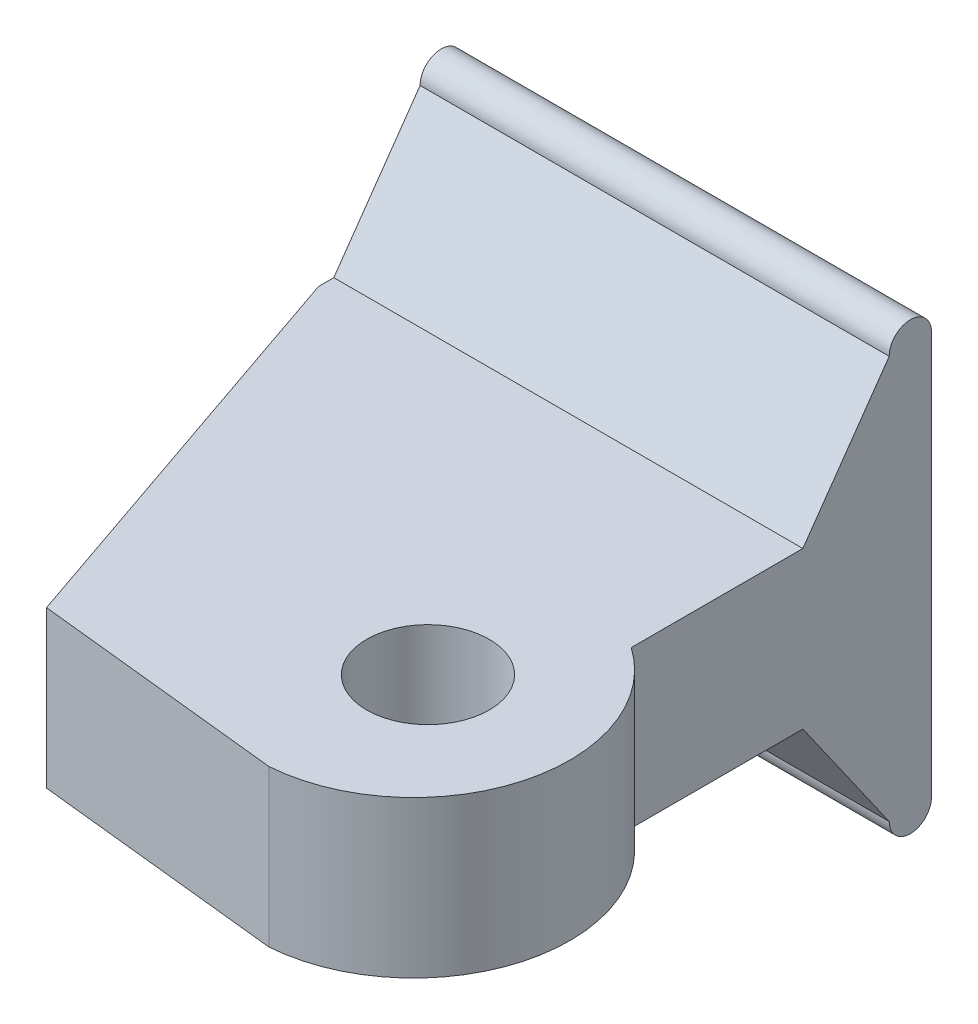
ISO-10303-21;
HEADER;
FILE_DESCRIPTION(('STEP AP214'),'2;1');
FILE_NAME('part.step','',(''),(''),'','','');
FILE_SCHEMA(('AUTOMOTIVE_DESIGN { 1 0 10303 214 1 1 1 1 }'));
ENDSEC;
DATA;
#1=APPLICATION_CONTEXT('core data for automotive mechanical design processes');
#2=APPLICATION_PROTOCOL_DEFINITION('international standard','automotive_design',2000,#1);
#3=PRODUCT_CONTEXT('',#1,'mechanical');
#4=PRODUCT('Part','Part','',(#3));
#5=PRODUCT_RELATED_PRODUCT_CATEGORY('part','',(#4));
#6=PRODUCT_DEFINITION_FORMATION('','',#4);
#7=PRODUCT_DEFINITION_CONTEXT('part definition',#1,'design');
#8=PRODUCT_DEFINITION('design','',#6,#7);
#9=PRODUCT_DEFINITION_SHAPE('','',#8);
#10=(LENGTH_UNIT() NAMED_UNIT(*) SI_UNIT(.MILLI.,.METRE.));
#11=(NAMED_UNIT(*) PLANE_ANGLE_UNIT() SI_UNIT($,.RADIAN.));
#12=(NAMED_UNIT(*) SI_UNIT($,.STERADIAN.) SOLID_ANGLE_UNIT());
#13=UNCERTAINTY_MEASURE_WITH_UNIT(LENGTH_MEASURE(1.E-05),#10,'distance_accuracy_value','');
#14=(GEOMETRIC_REPRESENTATION_CONTEXT(3) GLOBAL_UNCERTAINTY_ASSIGNED_CONTEXT((#13)) GLOBAL_UNIT_ASSIGNED_CONTEXT((#10,
#11,#12)) REPRESENTATION_CONTEXT('',''));
#15=CARTESIAN_POINT('',(0.,0.,0.));
#16=DIRECTION('',(0.,0.,1.));
#17=DIRECTION('',(1.,0.,0.));
#18=AXIS2_PLACEMENT_3D('',#15,#16,#17);
#19=CARTESIAN_POINT('',(12.7,6.35,0.));
#20=DIRECTION('',(-1.,0.,0.));
#21=DIRECTION('',(0.,0.,1.));
#22=AXIS2_PLACEMENT_3D('',#19,#20,#21);
#23=PLANE('',#22);
#24=DIRECTION('',(0.,0.,-1.));
#25=VECTOR('',#24,1.);
#26=CARTESIAN_POINT('',(12.7,0.,0.));
#27=LINE('',#26,#25);
#28=CARTESIAN_POINT('',(12.7,0.,6.35000000000004));
#29=VERTEX_POINT('',#28);
#30=CARTESIAN_POINT('',(12.7,0.,-0.620153491090818));
#31=VERTEX_POINT('',#30);
#32=EDGE_CURVE('E201',#29,#31,#27,.T.);
#33=ORIENTED_EDGE('',*,*,#32,.T.);
#34=DIRECTION('',(0.,-0.819152044288993,-0.573576436351044));
#35=VECTOR('',#34,1.);
#36=CARTESIAN_POINT('',(12.7,4.55229078472536,2.56739483249647));
#37=LINE('',#36,#35);
#38=CARTESIAN_POINT('',(12.7,-5.00602262218575,-4.12540826759358));
#39=VERTEX_POINT('',#38);
#40=EDGE_CURVE('E166',#31,#39,#37,.T.);
#41=ORIENTED_EDGE('',*,*,#40,.T.);
#42=CARTESIAN_POINT('',(12.7,-5.00602262218575,-4.98370413379679));
#43=DIRECTION('',(-1.,0.,0.));
#44=DIRECTION('',(0.,0.,1.));
#45=AXIS2_PLACEMENT_3D('',#42,#43,#44);
#46=CIRCLE('',#45,0.858295866203211);
#47=CARTESIAN_POINT('',(12.7,-5.00602262218575,-5.842));
#48=VERTEX_POINT('',#47);
#49=EDGE_CURVE('E112',#48,#39,#46,.T.);
#50=ORIENTED_EDGE('',*,*,#49,.F.);
#51=DIRECTION('',(0.,-1.,0.));
#52=VECTOR('',#51,1.);
#53=CARTESIAN_POINT('',(12.7,6.35,-5.842));
#54=LINE('',#53,#52);
#55=CARTESIAN_POINT('',(12.7,11.3560226221857,-5.842));
#56=VERTEX_POINT('',#55);
#57=EDGE_CURVE('E114',#56,#48,#54,.T.);
#58=ORIENTED_EDGE('',*,*,#57,.F.);
#59=CARTESIAN_POINT('',(12.7,11.3560226221857,-4.9837041337968));
#60=DIRECTION('',(-1.,0.,0.));
#61=DIRECTION('',(0.,0.,1.));
#62=AXIS2_PLACEMENT_3D('',#59,#60,#61);
#63=CIRCLE('',#62,0.858295866203201);
#64=CARTESIAN_POINT('',(12.7,11.3560226221857,-4.1254082675936));
#65=VERTEX_POINT('',#64);
#66=EDGE_CURVE('E148',#56,#65,#63,.F.);
#67=ORIENTED_EDGE('',*,*,#66,.T.);
#68=DIRECTION('',(0.,-0.819152044288991,0.573576436351047));
#69=VECTOR('',#68,1.);
#70=CARTESIAN_POINT('',(12.7,6.05862317033365,-0.416129238498795));
#71=LINE('',#70,#69);
#72=CARTESIAN_POINT('',(12.7,6.35,-0.620153491090819));
#73=VERTEX_POINT('',#72);
#74=EDGE_CURVE('E162',#65,#73,#71,.T.);
#75=ORIENTED_EDGE('',*,*,#74,.T.);
#76=DIRECTION('',(0.,0.,-1.));
#77=VECTOR('',#76,1.);
#78=CARTESIAN_POINT('',(12.7,6.35,0.));
#79=LINE('',#78,#77);
#80=CARTESIAN_POINT('',(12.7,6.35,6.35000000000004));
#81=VERTEX_POINT('',#80);
#82=EDGE_CURVE('E187',#81,#73,#79,.T.);
#83=ORIENTED_EDGE('',*,*,#82,.F.);
#84=DIRECTION('',(0.,-1.,0.));
#85=VECTOR('',#84,1.);
#86=CARTESIAN_POINT('',(12.7,6.35,6.35000000000004));
#87=LINE('',#86,#85);
#88=EDGE_CURVE('E135',#81,#29,#87,.T.);
#89=ORIENTED_EDGE('',*,*,#88,.T.);
#90=EDGE_LOOP('',(#33,#41,#50,#58,#67,#75,#83,#89));
#91=FACE_BOUND('',#90,.T.);
#92=ADVANCED_FACE('F38',(#91),#23,.F.);
#93=CARTESIAN_POINT('',(-6.35,12.9055102958205,0.));
#94=DIRECTION('',(1.,0.,0.));
#95=DIRECTION('',(0.,0.,-1.));
#96=AXIS2_PLACEMENT_3D('',#93,#94,#95);
#97=PLANE('',#96);
#98=DIRECTION('',(0.,0.,-1.));
#99=VECTOR('',#98,1.);
#100=CARTESIAN_POINT('',(-6.35,0.,3.97099124674215E-13));
#101=LINE('',#100,#99);
#102=CARTESIAN_POINT('',(-6.35,0.,0.));
#103=VERTEX_POINT('',#102);
#104=CARTESIAN_POINT('',(-6.35,0.,-0.620153491090818));
#105=VERTEX_POINT('',#104);
#106=EDGE_CURVE('E11',#103,#105,#101,.T.);
#107=ORIENTED_EDGE('',*,*,#106,.F.);
#108=DIRECTION('',(0.,-1.,0.));
#109=VECTOR('',#108,1.);
#110=CARTESIAN_POINT('',(-6.35,12.9055102958205,0.));
#111=LINE('',#110,#109);
#112=CARTESIAN_POINT('',(-6.35,6.35,0.));
#113=VERTEX_POINT('',#112);
#114=EDGE_CURVE('E171',#113,#103,#111,.T.);
#115=ORIENTED_EDGE('',*,*,#114,.F.);
#116=DIRECTION('',(0.,0.,-1.));
#117=VECTOR('',#116,1.);
#118=CARTESIAN_POINT('',(-6.35,6.35,0.));
#119=LINE('',#118,#117);
#120=CARTESIAN_POINT('',(-6.35,6.35,-0.620153491090819));
#121=VERTEX_POINT('',#120);
#122=EDGE_CURVE('E120',#113,#121,#119,.T.);
#123=ORIENTED_EDGE('',*,*,#122,.T.);
#124=DIRECTION('',(0.,0.819152044288991,-0.573576436351047));
#125=VECTOR('',#124,1.);
#126=CARTESIAN_POINT('',(-6.35,10.4574366037186,-3.4962115637331));
#127=LINE('',#126,#125);
#128=CARTESIAN_POINT('',(-6.35,11.3560226221857,-4.1254082675936));
#129=VERTEX_POINT('',#128);
#130=EDGE_CURVE('E123',#121,#129,#127,.T.);
#131=ORIENTED_EDGE('',*,*,#130,.T.);
#132=CARTESIAN_POINT('',(-6.35,11.3560226221857,-4.9837041337968));
#133=DIRECTION('',(-1.,0.,0.));
#134=DIRECTION('',(0.,0.,1.));
#135=AXIS2_PLACEMENT_3D('',#132,#133,#134);
#136=CIRCLE('',#135,0.858295866203201);
#137=CARTESIAN_POINT('',(-6.35,11.3560226221857,-5.842));
#138=VERTEX_POINT('',#137);
#139=EDGE_CURVE('E130',#129,#138,#136,.T.);
#140=ORIENTED_EDGE('',*,*,#139,.T.);
#141=DIRECTION('',(0.,1.,0.));
#142=VECTOR('',#141,1.);
#143=CARTESIAN_POINT('',(-6.35,0.,-5.842));
#144=LINE('',#143,#142);
#145=CARTESIAN_POINT('',(-6.35,-5.00602262218575,-5.842));
#146=VERTEX_POINT('',#145);
#147=EDGE_CURVE('E118',#146,#138,#144,.T.);
#148=ORIENTED_EDGE('',*,*,#147,.F.);
#149=CARTESIAN_POINT('',(-6.35,-5.00602262218575,-4.98370413379679));
#150=DIRECTION('',(-1.,0.,0.));
#151=DIRECTION('',(0.,0.,1.));
#152=AXIS2_PLACEMENT_3D('',#149,#150,#151);
#153=CIRCLE('',#152,0.858295866203211);
#154=CARTESIAN_POINT('',(-6.35,-5.00602262218575,-4.12540826759358));
#155=VERTEX_POINT('',#154);
#156=EDGE_CURVE('E42',#155,#146,#153,.F.);
#157=ORIENTED_EDGE('',*,*,#156,.F.);
#158=DIRECTION('',(0.,0.819152044288993,0.573576436351044));
#159=VECTOR('',#158,1.);
#160=CARTESIAN_POINT('',(-6.35,8.95110421811033,5.64747715773074));
#161=LINE('',#160,#159);
#162=EDGE_CURVE('E48',#155,#105,#161,.T.);
#163=ORIENTED_EDGE('',*,*,#162,.T.);
#164=EDGE_LOOP('',(#107,#115,#123,#131,#140,#148,#157,#163));
#165=FACE_BOUND('',#164,.T.);
#166=ADVANCED_FACE('F116',(#165),#97,.F.);
#167=CARTESIAN_POINT('',(9.06408672353238,6.35,11.5560190785289));
#168=DIRECTION('',(0.,1.,0.));
#169=DIRECTION('',(0.,0.,1.));
#170=AXIS2_PLACEMENT_3D('',#167,#168,#169);
#171=PLANE('',#170);
#172=CARTESIAN_POINT('',(9.06408672353238,6.35,11.5560190785289));
#173=DIRECTION('',(0.,1.,0.));
#174=DIRECTION('',(0.,0.,1.));
#175=AXIS2_PLACEMENT_3D('',#172,#173,#174);
#176=CIRCLE('',#175,6.35);
#177=CARTESIAN_POINT('',(9.52499999999998,6.35,17.889269346091));
#178=VERTEX_POINT('',#177);
#179=EDGE_CURVE('E184',#178,#81,#176,.T.);
#180=ORIENTED_EDGE('',*,*,#179,.T.);
#181=ORIENTED_EDGE('',*,*,#82,.T.);
#182=DIRECTION('',(-1.,0.,0.));
#183=VECTOR('',#182,1.);
#184=CARTESIAN_POINT('',(15.4140867235324,6.35,-0.620153491090819));
#185=LINE('',#184,#183);
#186=EDGE_CURVE('E154',#73,#121,#185,.T.);
#187=ORIENTED_EDGE('',*,*,#186,.T.);
#188=ORIENTED_EDGE('',*,*,#122,.F.);
#189=DIRECTION('',(0.324619143877709,0.,0.945844813607446));
#190=VECTOR('',#189,1.);
#191=CARTESIAN_POINT('',(-0.578271621854337,6.35,16.8171207859404));
#192=LINE('',#191,#190);
#193=CARTESIAN_POINT('',(-0.578271621854337,6.35,16.8171207859404));
#194=VERTEX_POINT('',#193);
#195=EDGE_CURVE('E192',#113,#194,#192,.T.);
#196=ORIENTED_EDGE('',*,*,#195,.T.);
#197=DIRECTION('',(0.994416498214008,0.,0.105526433085695));
#198=VECTOR('',#197,1.);
#199=CARTESIAN_POINT('',(9.52499999999998,6.35,17.889269346091));
#200=LINE('',#199,#198);
#201=EDGE_CURVE('E65',#194,#178,#200,.T.);
#202=ORIENTED_EDGE('',*,*,#201,.T.);
#203=EDGE_LOOP('',(#180,#181,#187,#188,#196,#202));
#204=FACE_BOUND('',#203,.T.);
#205=CARTESIAN_POINT('',(9.52499999999998,6.35,11.4299999999999));
#206=DIRECTION('',(0.,1.,0.));
#207=DIRECTION('',(0.,0.,1.));
#208=AXIS2_PLACEMENT_3D('',#205,#206,#207);
#209=CIRCLE('',#208,2.4892);
#210=CARTESIAN_POINT('',(9.52499999999998,6.35,13.9191999999999));
#211=VERTEX_POINT('',#210);
#212=EDGE_CURVE('E176',#211,#211,#209,.T.);
#213=ORIENTED_EDGE('',*,*,#212,.F.);
#214=EDGE_LOOP('',(#213));
#215=FACE_BOUND('',#214,.T.);
#216=ADVANCED_FACE('F238',(#204,#215),#171,.T.);
#217=CARTESIAN_POINT('',(9.06408672353238,0.,11.5560190785289));
#218=DIRECTION('',(0.,1.,0.));
#219=DIRECTION('',(0.,0.,1.));
#220=AXIS2_PLACEMENT_3D('',#217,#218,#219);
#221=PLANE('',#220);
#222=CARTESIAN_POINT('',(9.06408672353238,0.,11.5560190785289));
#223=DIRECTION('',(0.,1.,0.));
#224=DIRECTION('',(0.,0.,1.));
#225=AXIS2_PLACEMENT_3D('',#222,#223,#224);
#226=CIRCLE('',#225,6.35);
#227=CARTESIAN_POINT('',(9.52499999999998,0.,17.889269346091));
#228=VERTEX_POINT('',#227);
#229=EDGE_CURVE('E180',#228,#29,#226,.T.);
#230=ORIENTED_EDGE('',*,*,#229,.F.);
#231=DIRECTION('',(0.994416498214008,0.,0.105526433085695));
#232=VECTOR('',#231,1.);
#233=CARTESIAN_POINT('',(9.52499999999998,0.,17.889269346091));
#234=LINE('',#233,#232);
#235=CARTESIAN_POINT('',(-0.578271621854337,0.,16.8171207859404));
#236=VERTEX_POINT('',#235);
#237=EDGE_CURVE('E188',#236,#228,#234,.T.);
#238=ORIENTED_EDGE('',*,*,#237,.F.);
#239=DIRECTION('',(0.324619143877709,0.,0.945844813607446));
#240=VECTOR('',#239,1.);
#241=CARTESIAN_POINT('',(-0.578271621854337,0.,16.8171207859404));
#242=LINE('',#241,#240);
#243=EDGE_CURVE('E205',#103,#236,#242,.T.);
#244=ORIENTED_EDGE('',*,*,#243,.F.);
#245=ORIENTED_EDGE('',*,*,#106,.T.);
#246=DIRECTION('',(-1.,0.,0.));
#247=VECTOR('',#246,1.);
#248=CARTESIAN_POINT('',(15.4140867235324,0.,-0.620153491090818));
#249=LINE('',#248,#247);
#250=EDGE_CURVE('E101',#31,#105,#249,.T.);
#251=ORIENTED_EDGE('',*,*,#250,.F.);
#252=ORIENTED_EDGE('',*,*,#32,.F.);
#253=EDGE_LOOP('',(#230,#238,#244,#245,#251,#252));
#254=FACE_BOUND('',#253,.T.);
#255=CARTESIAN_POINT('',(9.52499999999998,0.,11.4299999999999));
#256=DIRECTION('',(0.,1.,0.));
#257=DIRECTION('',(0.,0.,1.));
#258=AXIS2_PLACEMENT_3D('',#255,#256,#257);
#259=CIRCLE('',#258,2.4892);
#260=CARTESIAN_POINT('',(9.52499999999998,0.,13.9191999999999));
#261=VERTEX_POINT('',#260);
#262=EDGE_CURVE('E175',#261,#261,#259,.T.);
#263=ORIENTED_EDGE('',*,*,#262,.T.);
#264=EDGE_LOOP('',(#263));
#265=FACE_BOUND('',#264,.T.);
#266=ADVANCED_FACE('F227',(#254,#265),#221,.F.);
#267=CARTESIAN_POINT('',(9.06408672353238,6.35,11.5560190785289));
#268=DIRECTION('',(0.,-1.,0.));
#269=DIRECTION('',(0.,0.,-1.));
#270=AXIS2_PLACEMENT_3D('',#267,#268,#269);
#271=CYLINDRICAL_SURFACE('',#270,6.35);
#272=ORIENTED_EDGE('',*,*,#229,.T.);
#273=ORIENTED_EDGE('',*,*,#88,.F.);
#274=ORIENTED_EDGE('',*,*,#179,.F.);
#275=DIRECTION('',(0.,-1.,0.));
#276=VECTOR('',#275,1.);
#277=CARTESIAN_POINT('',(9.52499999999998,6.35,17.889269346091));
#278=LINE('',#277,#276);
#279=EDGE_CURVE('E197',#178,#228,#278,.T.);
#280=ORIENTED_EDGE('',*,*,#279,.T.);
#281=EDGE_LOOP('',(#272,#273,#274,#280));
#282=FACE_BOUND('',#281,.T.);
#283=ADVANCED_FACE('F40',(#282),#271,.T.);
#284=CARTESIAN_POINT('',(-0.578271621854337,6.35,16.8171207859404));
#285=DIRECTION('',(0.945844813607445,0.,-0.324619143877709));
#286=DIRECTION('',(-0.324619143877709,0.,-0.945844813607446));
#287=AXIS2_PLACEMENT_3D('',#284,#285,#286);
#288=PLANE('',#287);
#289=ORIENTED_EDGE('',*,*,#195,.F.);
#290=ORIENTED_EDGE('',*,*,#114,.T.);
#291=ORIENTED_EDGE('',*,*,#243,.T.);
#292=DIRECTION('',(0.,-1.,0.));
#293=VECTOR('',#292,1.);
#294=CARTESIAN_POINT('',(-0.578271621854337,6.35,16.8171207859404));
#295=LINE('',#294,#293);
#296=EDGE_CURVE('E213',#194,#236,#295,.T.);
#297=ORIENTED_EDGE('',*,*,#296,.F.);
#298=EDGE_LOOP('',(#289,#290,#291,#297));
#299=FACE_BOUND('',#298,.T.);
#300=ADVANCED_FACE('F256',(#299),#288,.F.);
#301=CARTESIAN_POINT('',(9.52499999999998,6.35,17.889269346091));
#302=DIRECTION('',(0.105526433085695,0.,-0.994416498214008));
#303=DIRECTION('',(-0.994416498214008,0.,-0.105526433085695));
#304=AXIS2_PLACEMENT_3D('',#301,#302,#303);
#305=PLANE('',#304);
#306=ORIENTED_EDGE('',*,*,#237,.T.);
#307=ORIENTED_EDGE('',*,*,#279,.F.);
#308=ORIENTED_EDGE('',*,*,#201,.F.);
#309=ORIENTED_EDGE('',*,*,#296,.T.);
#310=EDGE_LOOP('',(#306,#307,#308,#309));
#311=FACE_BOUND('',#310,.T.);
#312=ADVANCED_FACE('F259',(#311),#305,.F.);
#313=CARTESIAN_POINT('',(9.52499999999998,6.35,11.4299999999999));
#314=DIRECTION('',(0.,-1.,0.));
#315=DIRECTION('',(0.,0.,-1.));
#316=AXIS2_PLACEMENT_3D('',#313,#314,#315);
#317=CYLINDRICAL_SURFACE('',#316,2.4892);
#318=ORIENTED_EDGE('',*,*,#212,.T.);
#319=EDGE_LOOP('',(#318));
#320=FACE_BOUND('',#319,.T.);
#321=ORIENTED_EDGE('',*,*,#262,.F.);
#322=EDGE_LOOP('',(#321));
#323=FACE_BOUND('',#322,.T.);
#324=ADVANCED_FACE('F261',(#320,#323),#317,.F.);
#325=CARTESIAN_POINT('',(15.4140867235324,-5.00602262218575,-4.98370413379679));
#326=DIRECTION('',(-1.,0.,0.));
#327=DIRECTION('',(0.,0.,1.));
#328=AXIS2_PLACEMENT_3D('',#325,#326,#327);
#329=CYLINDRICAL_SURFACE('',#328,0.858295866203211);
#330=ORIENTED_EDGE('',*,*,#49,.T.);
#331=DIRECTION('',(-1.,0.,0.));
#332=VECTOR('',#331,1.);
#333=CARTESIAN_POINT('',(15.4140867235324,-5.00602262218575,-4.12540826759358));
#334=LINE('',#333,#332);
#335=EDGE_CURVE('E97',#39,#155,#334,.T.);
#336=ORIENTED_EDGE('',*,*,#335,.T.);
#337=ORIENTED_EDGE('',*,*,#156,.T.);
#338=DIRECTION('',(-1.,0.,0.));
#339=VECTOR('',#338,1.);
#340=CARTESIAN_POINT('',(15.4140867235324,-5.00602262218575,-5.842));
#341=LINE('',#340,#339);
#342=EDGE_CURVE('E56',#48,#146,#341,.T.);
#343=ORIENTED_EDGE('',*,*,#342,.F.);
#344=EDGE_LOOP('',(#330,#336,#337,#343));
#345=FACE_BOUND('',#344,.T.);
#346=ADVANCED_FACE('F109',(#345),#329,.T.);
#347=CARTESIAN_POINT('',(15.4140867235324,0.291376829666324,-0.416129238498799));
#348=DIRECTION('',(0.,0.573576436351044,-0.819152044288993));
#349=DIRECTION('',(0.,0.819152044288993,0.573576436351044));
#350=AXIS2_PLACEMENT_3D('',#347,#348,#349);
#351=PLANE('',#350);
#352=ORIENTED_EDGE('',*,*,#250,.T.);
#353=ORIENTED_EDGE('',*,*,#162,.F.);
#354=ORIENTED_EDGE('',*,*,#335,.F.);
#355=ORIENTED_EDGE('',*,*,#40,.F.);
#356=EDGE_LOOP('',(#352,#353,#354,#355));
#357=FACE_BOUND('',#356,.T.);
#358=ADVANCED_FACE('F95',(#357),#351,.F.);
#359=CARTESIAN_POINT('',(15.4140867235324,1.79770921527467,2.56739483249645));
#360=DIRECTION('',(0.,-0.573576436351047,-0.819152044288991));
#361=DIRECTION('',(0.,0.819152044288991,-0.573576436351047));
#362=AXIS2_PLACEMENT_3D('',#359,#360,#361);
#363=PLANE('',#362);
#364=DIRECTION('',(-1.,0.,0.));
#365=VECTOR('',#364,1.);
#366=CARTESIAN_POINT('',(15.4140867235324,11.3560226221857,-4.1254082675936));
#367=LINE('',#366,#365);
#368=EDGE_CURVE('E144',#65,#129,#367,.T.);
#369=ORIENTED_EDGE('',*,*,#368,.T.);
#370=ORIENTED_EDGE('',*,*,#130,.F.);
#371=ORIENTED_EDGE('',*,*,#186,.F.);
#372=ORIENTED_EDGE('',*,*,#74,.F.);
#373=EDGE_LOOP('',(#369,#370,#371,#372));
#374=FACE_BOUND('',#373,.T.);
#375=ADVANCED_FACE('F245',(#374),#363,.F.);
#376=CARTESIAN_POINT('',(15.4140867235324,11.3560226221857,-4.9837041337968));
#377=DIRECTION('',(-1.,0.,0.));
#378=DIRECTION('',(0.,0.,1.));
#379=AXIS2_PLACEMENT_3D('',#376,#377,#378);
#380=CYLINDRICAL_SURFACE('',#379,0.858295866203201);
#381=DIRECTION('',(-1.,0.,0.));
#382=VECTOR('',#381,1.);
#383=CARTESIAN_POINT('',(15.4140867235324,11.3560226221857,-5.842));
#384=LINE('',#383,#382);
#385=EDGE_CURVE('E147',#56,#138,#384,.T.);
#386=ORIENTED_EDGE('',*,*,#385,.T.);
#387=ORIENTED_EDGE('',*,*,#139,.F.);
#388=ORIENTED_EDGE('',*,*,#368,.F.);
#389=ORIENTED_EDGE('',*,*,#66,.F.);
#390=EDGE_LOOP('',(#386,#387,#388,#389));
#391=FACE_BOUND('',#390,.T.);
#392=ADVANCED_FACE('F142',(#391),#380,.T.);
#393=CARTESIAN_POINT('',(15.4140867235324,0.,-5.842));
#394=DIRECTION('',(0.,0.,-1.));
#395=DIRECTION('',(0.,1.,0.));
#396=AXIS2_PLACEMENT_3D('',#393,#394,#395);
#397=PLANE('',#396);
#398=ORIENTED_EDGE('',*,*,#57,.T.);
#399=ORIENTED_EDGE('',*,*,#342,.T.);
#400=ORIENTED_EDGE('',*,*,#147,.T.);
#401=ORIENTED_EDGE('',*,*,#385,.F.);
#402=EDGE_LOOP('',(#398,#399,#400,#401));
#403=FACE_BOUND('',#402,.T.);
#404=ADVANCED_FACE('F330',(#403),#397,.T.);
#405=CLOSED_SHELL('',(#92,#166,#216,#266,#283,#300,#312,#324,#346,#358,#375,#392,#404));
#406=MANIFOLD_SOLID_BREP('B2',#405);
#407=ADVANCED_BREP_SHAPE_REPRESENTATION('',(#18,#406),#14);
#408=SHAPE_DEFINITION_REPRESENTATION(#9,#407);
ENDSEC;
END-ISO-10303-21;
